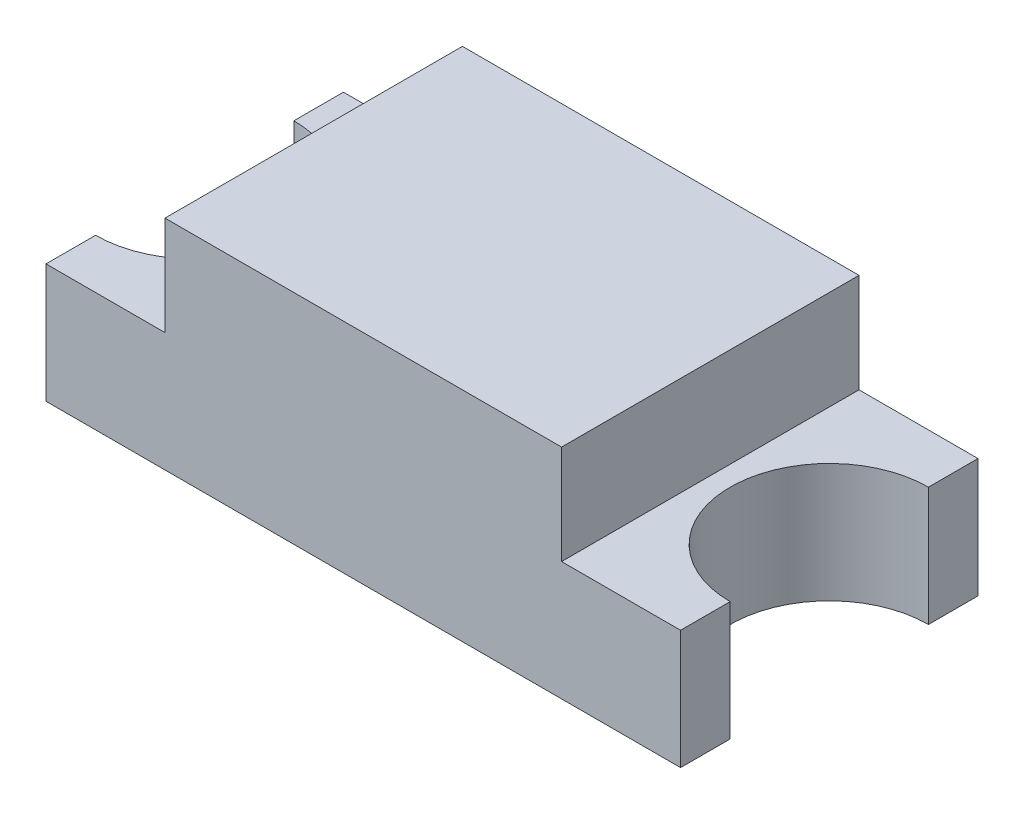
ISO-10303-21;
HEADER;
FILE_DESCRIPTION(('STEP AP214'),'2;1');
FILE_NAME('part.step','',(''),(''),'','','');
FILE_SCHEMA(('AUTOMOTIVE_DESIGN { 1 0 10303 214 1 1 1 1 }'));
ENDSEC;
DATA;
#1=APPLICATION_CONTEXT('core data for automotive mechanical design processes');
#2=APPLICATION_PROTOCOL_DEFINITION('international standard','automotive_design',2000,#1);
#3=PRODUCT_CONTEXT('',#1,'mechanical');
#4=PRODUCT('Part','Part','',(#3));
#5=PRODUCT_RELATED_PRODUCT_CATEGORY('part','',(#4));
#6=PRODUCT_DEFINITION_FORMATION('','',#4);
#7=PRODUCT_DEFINITION_CONTEXT('part definition',#1,'design');
#8=PRODUCT_DEFINITION('design','',#6,#7);
#9=PRODUCT_DEFINITION_SHAPE('','',#8);
#10=(LENGTH_UNIT() NAMED_UNIT(*) SI_UNIT(.MILLI.,.METRE.));
#11=(NAMED_UNIT(*) PLANE_ANGLE_UNIT() SI_UNIT($,.RADIAN.));
#12=(NAMED_UNIT(*) SI_UNIT($,.STERADIAN.) SOLID_ANGLE_UNIT());
#13=UNCERTAINTY_MEASURE_WITH_UNIT(LENGTH_MEASURE(1.E-05),#10,'distance_accuracy_value','');
#14=(GEOMETRIC_REPRESENTATION_CONTEXT(3) GLOBAL_UNCERTAINTY_ASSIGNED_CONTEXT((#13)) GLOBAL_UNIT_ASSIGNED_CONTEXT((#10,
#11,#12)) REPRESENTATION_CONTEXT('',''));
#15=CARTESIAN_POINT('',(0.,0.,0.));
#16=DIRECTION('',(0.,0.,1.));
#17=DIRECTION('',(1.,0.,0.));
#18=AXIS2_PLACEMENT_3D('',#15,#16,#17);
#19=CARTESIAN_POINT('',(-1.,1.1,0.750000000000001));
#20=DIRECTION('',(1.,0.,0.));
#21=DIRECTION('',(0.,0.,-1.));
#22=AXIS2_PLACEMENT_3D('',#19,#20,#21);
#23=PLANE('',#22);
#24=DIRECTION('',(0.,1.,0.));
#25=VECTOR('',#24,1.);
#26=CARTESIAN_POINT('',(-1.,1.1,0.750000000000001));
#27=LINE('',#26,#25);
#28=CARTESIAN_POINT('',(-1.,1.1,0.750000000000001));
#29=VERTEX_POINT('',#28);
#30=CARTESIAN_POINT('',(-1.,0.6,0.750000000000001));
#31=VERTEX_POINT('',#30);
#32=EDGE_CURVE('E165',#29,#31,#27,.F.);
#33=ORIENTED_EDGE('',*,*,#32,.F.);
#34=DIRECTION('',(0.,0.,-1.));
#35=VECTOR('',#34,1.);
#36=CARTESIAN_POINT('',(-1.,1.1,0.));
#37=LINE('',#36,#35);
#38=CARTESIAN_POINT('',(-1.,1.1,-0.750000000000001));
#39=VERTEX_POINT('',#38);
#40=EDGE_CURVE('E145',#29,#39,#37,.T.);
#41=ORIENTED_EDGE('',*,*,#40,.T.);
#42=DIRECTION('',(0.,1.,0.));
#43=VECTOR('',#42,1.);
#44=CARTESIAN_POINT('',(-1.,1.1,-0.750000000000001));
#45=LINE('',#44,#43);
#46=CARTESIAN_POINT('',(-1.,0.6,-0.750000000000001));
#47=VERTEX_POINT('',#46);
#48=EDGE_CURVE('E168',#47,#39,#45,.T.);
#49=ORIENTED_EDGE('',*,*,#48,.F.);
#50=DIRECTION('',(0.,0.,-1.));
#51=VECTOR('',#50,1.);
#52=CARTESIAN_POINT('',(-1.,0.6,0.));
#53=LINE('',#52,#51);
#54=EDGE_CURVE('E146',#47,#31,#53,.F.);
#55=ORIENTED_EDGE('',*,*,#54,.T.);
#56=EDGE_LOOP('',(#33,#41,#49,#55));
#57=FACE_BOUND('',#56,.T.);
#58=ADVANCED_FACE('F17',(#57),#23,.F.);
#59=CARTESIAN_POINT('',(1.,1.1,0.750000000000001));
#60=DIRECTION('',(-1.,0.,0.));
#61=DIRECTION('',(0.,0.,1.));
#62=AXIS2_PLACEMENT_3D('',#59,#60,#61);
#63=PLANE('',#62);
#64=DIRECTION('',(0.,1.,0.));
#65=VECTOR('',#64,1.);
#66=CARTESIAN_POINT('',(1.,1.1,-0.750000000000001));
#67=LINE('',#66,#65);
#68=CARTESIAN_POINT('',(1.,1.1,-0.750000000000001));
#69=VERTEX_POINT('',#68);
#70=CARTESIAN_POINT('',(1.,0.6,-0.750000000000001));
#71=VERTEX_POINT('',#70);
#72=EDGE_CURVE('E176',#69,#71,#67,.F.);
#73=ORIENTED_EDGE('',*,*,#72,.F.);
#74=DIRECTION('',(0.,0.,-1.));
#75=VECTOR('',#74,1.);
#76=CARTESIAN_POINT('',(1.,1.1,0.));
#77=LINE('',#76,#75);
#78=CARTESIAN_POINT('',(1.,1.1,0.750000000000001));
#79=VERTEX_POINT('',#78);
#80=EDGE_CURVE('E122',#69,#79,#77,.F.);
#81=ORIENTED_EDGE('',*,*,#80,.T.);
#82=DIRECTION('',(0.,1.,0.));
#83=VECTOR('',#82,1.);
#84=CARTESIAN_POINT('',(1.,1.1,0.750000000000001));
#85=LINE('',#84,#83);
#86=CARTESIAN_POINT('',(1.,0.6,0.750000000000001));
#87=VERTEX_POINT('',#86);
#88=EDGE_CURVE('E167',#87,#79,#85,.T.);
#89=ORIENTED_EDGE('',*,*,#88,.F.);
#90=DIRECTION('',(0.,0.,-1.));
#91=VECTOR('',#90,1.);
#92=CARTESIAN_POINT('',(1.,0.6,0.));
#93=LINE('',#92,#91);
#94=EDGE_CURVE('E175',#87,#71,#93,.T.);
#95=ORIENTED_EDGE('',*,*,#94,.T.);
#96=EDGE_LOOP('',(#73,#81,#89,#95));
#97=FACE_BOUND('',#96,.T.);
#98=ADVANCED_FACE('F377',(#97),#63,.F.);
#99=CARTESIAN_POINT('',(0.,0.6,0.));
#100=DIRECTION('',(0.,-1.,0.));
#101=DIRECTION('',(0.,0.,-1.));
#102=AXIS2_PLACEMENT_3D('',#99,#100,#101);
#103=PLANE('',#102);
#104=CARTESIAN_POINT('',(1.60000000000001,0.6,0.));
#105=DIRECTION('',(0.,1.,0.));
#106=DIRECTION('',(0.,0.,1.));
#107=AXIS2_PLACEMENT_3D('',#104,#105,#106);
#108=CIRCLE('',#107,0.5);
#109=CARTESIAN_POINT('',(1.60000000000001,0.6,0.5));
#110=VERTEX_POINT('',#109);
#111=CARTESIAN_POINT('',(1.60000000000001,0.6,-0.5));
#112=VERTEX_POINT('',#111);
#113=EDGE_CURVE('E20',#110,#112,#108,.F.);
#114=ORIENTED_EDGE('',*,*,#113,.T.);
#115=DIRECTION('',(0.,0.,-1.));
#116=VECTOR('',#115,1.);
#117=CARTESIAN_POINT('',(1.60000000000001,0.6,0.));
#118=LINE('',#117,#116);
#119=CARTESIAN_POINT('',(1.60000000000001,0.6,-0.750000000000001));
#120=VERTEX_POINT('',#119);
#121=EDGE_CURVE('E114',#120,#112,#118,.F.);
#122=ORIENTED_EDGE('',*,*,#121,.F.);
#123=DIRECTION('',(1.,0.,0.));
#124=VECTOR('',#123,1.);
#125=CARTESIAN_POINT('',(0.,0.6,-0.750000000000001));
#126=LINE('',#125,#124);
#127=EDGE_CURVE('E159',#71,#120,#126,.T.);
#128=ORIENTED_EDGE('',*,*,#127,.F.);
#129=ORIENTED_EDGE('',*,*,#94,.F.);
#130=DIRECTION('',(1.,0.,0.));
#131=VECTOR('',#130,1.);
#132=CARTESIAN_POINT('',(0.,0.6,0.750000000000001));
#133=LINE('',#132,#131);
#134=CARTESIAN_POINT('',(1.60000000000001,0.6,0.750000000000001));
#135=VERTEX_POINT('',#134);
#136=EDGE_CURVE('E109',#135,#87,#133,.F.);
#137=ORIENTED_EDGE('',*,*,#136,.F.);
#138=DIRECTION('',(0.,0.,-1.));
#139=VECTOR('',#138,1.);
#140=CARTESIAN_POINT('',(1.60000000000001,0.6,0.));
#141=LINE('',#140,#139);
#142=EDGE_CURVE('E103',#110,#135,#141,.F.);
#143=ORIENTED_EDGE('',*,*,#142,.F.);
#144=EDGE_LOOP('',(#114,#122,#128,#129,#137,#143));
#145=FACE_BOUND('',#144,.T.);
#146=ADVANCED_FACE('F105',(#145),#103,.F.);
#147=CARTESIAN_POINT('',(0.,0.6,0.));
#148=DIRECTION('',(0.,-1.,0.));
#149=DIRECTION('',(0.,0.,-1.));
#150=AXIS2_PLACEMENT_3D('',#147,#148,#149);
#151=PLANE('',#150);
#152=CARTESIAN_POINT('',(-1.59999999999999,0.6,0.));
#153=DIRECTION('',(0.,1.,0.));
#154=DIRECTION('',(0.,0.,1.));
#155=AXIS2_PLACEMENT_3D('',#152,#153,#154);
#156=CIRCLE('',#155,0.5);
#157=CARTESIAN_POINT('',(-1.59999999999999,0.6,-0.5));
#158=VERTEX_POINT('',#157);
#159=CARTESIAN_POINT('',(-1.59999999999999,0.6,0.5));
#160=VERTEX_POINT('',#159);
#161=EDGE_CURVE('E139',#158,#160,#156,.F.);
#162=ORIENTED_EDGE('',*,*,#161,.T.);
#163=DIRECTION('',(0.,0.,-1.));
#164=VECTOR('',#163,1.);
#165=CARTESIAN_POINT('',(-1.59999999999999,0.6,0.750000000000001));
#166=LINE('',#165,#164);
#167=CARTESIAN_POINT('',(-1.59999999999999,0.6,0.750000000000001));
#168=VERTEX_POINT('',#167);
#169=EDGE_CURVE('E136',#160,#168,#166,.F.);
#170=ORIENTED_EDGE('',*,*,#169,.T.);
#171=DIRECTION('',(-1.,0.,0.));
#172=VECTOR('',#171,1.);
#173=CARTESIAN_POINT('',(-1.59999999999999,0.6,0.750000000000001));
#174=LINE('',#173,#172);
#175=EDGE_CURVE('E127',#168,#31,#174,.F.);
#176=ORIENTED_EDGE('',*,*,#175,.T.);
#177=ORIENTED_EDGE('',*,*,#54,.F.);
#178=DIRECTION('',(1.,0.,0.));
#179=VECTOR('',#178,1.);
#180=CARTESIAN_POINT('',(0.,0.6,-0.750000000000001));
#181=LINE('',#180,#179);
#182=CARTESIAN_POINT('',(-1.59999999999999,0.6,-0.750000000000001));
#183=VERTEX_POINT('',#182);
#184=EDGE_CURVE('E113',#183,#47,#181,.T.);
#185=ORIENTED_EDGE('',*,*,#184,.F.);
#186=DIRECTION('',(0.,0.,-1.));
#187=VECTOR('',#186,1.);
#188=CARTESIAN_POINT('',(-1.59999999999999,0.6,0.));
#189=LINE('',#188,#187);
#190=EDGE_CURVE('E143',#158,#183,#189,.T.);
#191=ORIENTED_EDGE('',*,*,#190,.F.);
#192=EDGE_LOOP('',(#162,#170,#176,#177,#185,#191));
#193=FACE_BOUND('',#192,.T.);
#194=ADVANCED_FACE('F361',(#193),#151,.F.);
#195=CARTESIAN_POINT('',(0.,1.1,0.));
#196=DIRECTION('',(0.,-1.,0.));
#197=DIRECTION('',(0.,0.,-1.));
#198=AXIS2_PLACEMENT_3D('',#195,#196,#197);
#199=PLANE('',#198);
#200=DIRECTION('',(1.,0.,0.));
#201=VECTOR('',#200,1.);
#202=CARTESIAN_POINT('',(-1.59999999999999,1.1,-0.750000000000001));
#203=LINE('',#202,#201);
#204=EDGE_CURVE('E196',#69,#39,#203,.F.);
#205=ORIENTED_EDGE('',*,*,#204,.T.);
#206=ORIENTED_EDGE('',*,*,#40,.F.);
#207=DIRECTION('',(-1.,0.,0.));
#208=VECTOR('',#207,1.);
#209=CARTESIAN_POINT('',(-1.59999999999999,1.1,0.750000000000001));
#210=LINE('',#209,#208);
#211=EDGE_CURVE('E130',#29,#79,#210,.F.);
#212=ORIENTED_EDGE('',*,*,#211,.T.);
#213=ORIENTED_EDGE('',*,*,#80,.F.);
#214=EDGE_LOOP('',(#205,#206,#212,#213));
#215=FACE_BOUND('',#214,.T.);
#216=ADVANCED_FACE('F353',(#215),#199,.F.);
#217=CARTESIAN_POINT('',(1.60000000000001,-0.00100000000000002,0.));
#218=DIRECTION('',(0.,1.,0.));
#219=DIRECTION('',(0.,0.,1.));
#220=AXIS2_PLACEMENT_3D('',#217,#218,#219);
#221=CYLINDRICAL_SURFACE('',#220,0.5);
#222=CARTESIAN_POINT('',(1.60000000000001,0.,0.));
#223=DIRECTION('',(0.,1.,0.));
#224=DIRECTION('',(0.,0.,1.));
#225=AXIS2_PLACEMENT_3D('',#222,#223,#224);
#226=CIRCLE('',#225,0.5);
#227=CARTESIAN_POINT('',(1.60000000000001,0.,-0.5));
#228=VERTEX_POINT('',#227);
#229=CARTESIAN_POINT('',(1.60000000000001,0.,0.5));
#230=VERTEX_POINT('',#229);
#231=EDGE_CURVE('E217',#228,#230,#226,.T.);
#232=ORIENTED_EDGE('',*,*,#231,.F.);
#233=DIRECTION('',(0.,1.,0.));
#234=VECTOR('',#233,1.);
#235=CARTESIAN_POINT('',(1.60000000000001,0.6,-0.5));
#236=LINE('',#235,#234);
#237=EDGE_CURVE('E121',#228,#112,#236,.T.);
#238=ORIENTED_EDGE('',*,*,#237,.T.);
#239=ORIENTED_EDGE('',*,*,#113,.F.);
#240=DIRECTION('',(0.,1.,0.));
#241=VECTOR('',#240,1.);
#242=CARTESIAN_POINT('',(1.60000000000001,0.6,0.5));
#243=LINE('',#242,#241);
#244=EDGE_CURVE('E118',#110,#230,#243,.F.);
#245=ORIENTED_EDGE('',*,*,#244,.T.);
#246=EDGE_LOOP('',(#232,#238,#239,#245));
#247=FACE_BOUND('',#246,.T.);
#248=ADVANCED_FACE('F117',(#247),#221,.F.);
#249=CARTESIAN_POINT('',(1.60000000000001,0.6,0.750000000000001));
#250=DIRECTION('',(-1.,0.,0.));
#251=DIRECTION('',(0.,0.,1.));
#252=AXIS2_PLACEMENT_3D('',#249,#250,#251);
#253=PLANE('',#252);
#254=ORIENTED_EDGE('',*,*,#244,.F.);
#255=ORIENTED_EDGE('',*,*,#142,.T.);
#256=DIRECTION('',(0.,1.,0.));
#257=VECTOR('',#256,1.);
#258=CARTESIAN_POINT('',(1.60000000000001,0.6,0.750000000000001));
#259=LINE('',#258,#257);
#260=CARTESIAN_POINT('',(1.60000000000001,0.,0.750000000000001));
#261=VERTEX_POINT('',#260);
#262=EDGE_CURVE('E205',#135,#261,#259,.F.);
#263=ORIENTED_EDGE('',*,*,#262,.T.);
#264=DIRECTION('',(0.,0.,-1.));
#265=VECTOR('',#264,1.);
#266=CARTESIAN_POINT('',(1.60000000000001,0.,0.));
#267=LINE('',#266,#265);
#268=EDGE_CURVE('E125',#230,#261,#267,.F.);
#269=ORIENTED_EDGE('',*,*,#268,.F.);
#270=EDGE_LOOP('',(#254,#255,#263,#269));
#271=FACE_BOUND('',#270,.T.);
#272=ADVANCED_FACE('F123',(#271),#253,.F.);
#273=CARTESIAN_POINT('',(-1.59999999999999,0.6,0.750000000000001));
#274=DIRECTION('',(0.,0.,-1.));
#275=DIRECTION('',(-1.,0.,0.));
#276=AXIS2_PLACEMENT_3D('',#273,#274,#275);
#277=PLANE('',#276);
#278=ORIENTED_EDGE('',*,*,#262,.F.);
#279=ORIENTED_EDGE('',*,*,#136,.T.);
#280=ORIENTED_EDGE('',*,*,#88,.T.);
#281=ORIENTED_EDGE('',*,*,#211,.F.);
#282=ORIENTED_EDGE('',*,*,#32,.T.);
#283=ORIENTED_EDGE('',*,*,#175,.F.);
#284=DIRECTION('',(0.,1.,0.));
#285=VECTOR('',#284,1.);
#286=CARTESIAN_POINT('',(-1.59999999999999,0.6,0.750000000000001));
#287=LINE('',#286,#285);
#288=CARTESIAN_POINT('',(-1.59999999999999,0.,0.750000000000001));
#289=VERTEX_POINT('',#288);
#290=EDGE_CURVE('E140',#168,#289,#287,.F.);
#291=ORIENTED_EDGE('',*,*,#290,.T.);
#292=DIRECTION('',(1.,0.,0.));
#293=VECTOR('',#292,1.);
#294=CARTESIAN_POINT('',(0.,0.,0.750000000000001));
#295=LINE('',#294,#293);
#296=EDGE_CURVE('E233',#261,#289,#295,.F.);
#297=ORIENTED_EDGE('',*,*,#296,.F.);
#298=EDGE_LOOP('',(#278,#279,#280,#281,#282,#283,#291,#297));
#299=FACE_BOUND('',#298,.T.);
#300=ADVANCED_FACE('F239',(#299),#277,.F.);
#301=CARTESIAN_POINT('',(-1.59999999999999,0.6,0.750000000000001));
#302=DIRECTION('',(1.,0.,0.));
#303=DIRECTION('',(0.,0.,-1.));
#304=AXIS2_PLACEMENT_3D('',#301,#302,#303);
#305=PLANE('',#304);
#306=DIRECTION('',(0.,1.,0.));
#307=VECTOR('',#306,1.);
#308=CARTESIAN_POINT('',(-1.59999999999999,-0.00100000000000002,0.5));
#309=LINE('',#308,#307);
#310=CARTESIAN_POINT('',(-1.59999999999999,0.,0.5));
#311=VERTEX_POINT('',#310);
#312=EDGE_CURVE('E218',#160,#311,#309,.F.);
#313=ORIENTED_EDGE('',*,*,#312,.T.);
#314=DIRECTION('',(0.,0.,-1.));
#315=VECTOR('',#314,1.);
#316=CARTESIAN_POINT('',(-1.59999999999999,0.,0.));
#317=LINE('',#316,#315);
#318=EDGE_CURVE('E216',#289,#311,#317,.T.);
#319=ORIENTED_EDGE('',*,*,#318,.F.);
#320=ORIENTED_EDGE('',*,*,#290,.F.);
#321=ORIENTED_EDGE('',*,*,#169,.F.);
#322=EDGE_LOOP('',(#313,#319,#320,#321));
#323=FACE_BOUND('',#322,.T.);
#324=ADVANCED_FACE('F273',(#323),#305,.F.);
#325=CARTESIAN_POINT('',(-1.59999999999999,-0.00100000000000002,0.));
#326=DIRECTION('',(0.,1.,0.));
#327=DIRECTION('',(0.,0.,1.));
#328=AXIS2_PLACEMENT_3D('',#325,#326,#327);
#329=CYLINDRICAL_SURFACE('',#328,0.5);
#330=CARTESIAN_POINT('',(-1.59999999999999,0.,0.));
#331=DIRECTION('',(0.,1.,0.));
#332=DIRECTION('',(0.,0.,1.));
#333=AXIS2_PLACEMENT_3D('',#330,#331,#332);
#334=CIRCLE('',#333,0.5);
#335=CARTESIAN_POINT('',(-1.59999999999999,0.,-0.5));
#336=VERTEX_POINT('',#335);
#337=EDGE_CURVE('E212',#311,#336,#334,.T.);
#338=ORIENTED_EDGE('',*,*,#337,.F.);
#339=ORIENTED_EDGE('',*,*,#312,.F.);
#340=ORIENTED_EDGE('',*,*,#161,.F.);
#341=DIRECTION('',(0.,1.,0.));
#342=VECTOR('',#341,1.);
#343=CARTESIAN_POINT('',(-1.59999999999999,0.6,-0.5));
#344=LINE('',#343,#342);
#345=EDGE_CURVE('E200',#158,#336,#344,.F.);
#346=ORIENTED_EDGE('',*,*,#345,.T.);
#347=EDGE_LOOP('',(#338,#339,#340,#346));
#348=FACE_BOUND('',#347,.T.);
#349=ADVANCED_FACE('F275',(#348),#329,.F.);
#350=CARTESIAN_POINT('',(-1.59999999999999,0.6,0.750000000000001));
#351=DIRECTION('',(1.,0.,0.));
#352=DIRECTION('',(0.,0.,-1.));
#353=AXIS2_PLACEMENT_3D('',#350,#351,#352);
#354=PLANE('',#353);
#355=ORIENTED_EDGE('',*,*,#345,.F.);
#356=ORIENTED_EDGE('',*,*,#190,.T.);
#357=DIRECTION('',(0.,1.,0.));
#358=VECTOR('',#357,1.);
#359=CARTESIAN_POINT('',(-1.59999999999999,0.6,-0.750000000000001));
#360=LINE('',#359,#358);
#361=CARTESIAN_POINT('',(-1.59999999999999,0.,-0.750000000000001));
#362=VERTEX_POINT('',#361);
#363=EDGE_CURVE('E199',#183,#362,#360,.F.);
#364=ORIENTED_EDGE('',*,*,#363,.T.);
#365=DIRECTION('',(0.,0.,-1.));
#366=VECTOR('',#365,1.);
#367=CARTESIAN_POINT('',(-1.59999999999999,0.,0.));
#368=LINE('',#367,#366);
#369=EDGE_CURVE('E215',#336,#362,#368,.T.);
#370=ORIENTED_EDGE('',*,*,#369,.F.);
#371=EDGE_LOOP('',(#355,#356,#364,#370));
#372=FACE_BOUND('',#371,.T.);
#373=ADVANCED_FACE('F264',(#372),#354,.F.);
#374=CARTESIAN_POINT('',(-1.59999999999999,0.6,-0.750000000000001));
#375=DIRECTION('',(0.,0.,1.));
#376=DIRECTION('',(1.,0.,0.));
#377=AXIS2_PLACEMENT_3D('',#374,#375,#376);
#378=PLANE('',#377);
#379=ORIENTED_EDGE('',*,*,#363,.F.);
#380=ORIENTED_EDGE('',*,*,#184,.T.);
#381=ORIENTED_EDGE('',*,*,#48,.T.);
#382=ORIENTED_EDGE('',*,*,#204,.F.);
#383=ORIENTED_EDGE('',*,*,#72,.T.);
#384=ORIENTED_EDGE('',*,*,#127,.T.);
#385=DIRECTION('',(0.,1.,0.));
#386=VECTOR('',#385,1.);
#387=CARTESIAN_POINT('',(1.60000000000001,0.6,-0.750000000000001));
#388=LINE('',#387,#386);
#389=CARTESIAN_POINT('',(1.60000000000001,0.,-0.750000000000001));
#390=VERTEX_POINT('',#389);
#391=EDGE_CURVE('E35',#120,#390,#388,.F.);
#392=ORIENTED_EDGE('',*,*,#391,.T.);
#393=DIRECTION('',(1.,0.,0.));
#394=VECTOR('',#393,1.);
#395=CARTESIAN_POINT('',(0.,0.,-0.750000000000001));
#396=LINE('',#395,#394);
#397=EDGE_CURVE('E26',#362,#390,#396,.T.);
#398=ORIENTED_EDGE('',*,*,#397,.F.);
#399=EDGE_LOOP('',(#379,#380,#381,#382,#383,#384,#392,#398));
#400=FACE_BOUND('',#399,.T.);
#401=ADVANCED_FACE('F267',(#400),#378,.F.);
#402=CARTESIAN_POINT('',(1.60000000000001,0.6,0.750000000000001));
#403=DIRECTION('',(-1.,0.,0.));
#404=DIRECTION('',(0.,0.,1.));
#405=AXIS2_PLACEMENT_3D('',#402,#403,#404);
#406=PLANE('',#405);
#407=ORIENTED_EDGE('',*,*,#237,.F.);
#408=DIRECTION('',(0.,0.,-1.));
#409=VECTOR('',#408,1.);
#410=CARTESIAN_POINT('',(1.60000000000001,0.,0.));
#411=LINE('',#410,#409);
#412=EDGE_CURVE('E11',#390,#228,#411,.F.);
#413=ORIENTED_EDGE('',*,*,#412,.F.);
#414=ORIENTED_EDGE('',*,*,#391,.F.);
#415=ORIENTED_EDGE('',*,*,#121,.T.);
#416=EDGE_LOOP('',(#407,#413,#414,#415));
#417=FACE_BOUND('',#416,.T.);
#418=ADVANCED_FACE('F286',(#417),#406,.F.);
#419=CARTESIAN_POINT('',(0.,0.,0.));
#420=DIRECTION('',(0.,-1.,0.));
#421=DIRECTION('',(0.,0.,-1.));
#422=AXIS2_PLACEMENT_3D('',#419,#420,#421);
#423=PLANE('',#422);
#424=ORIENTED_EDGE('',*,*,#397,.T.);
#425=ORIENTED_EDGE('',*,*,#412,.T.);
#426=ORIENTED_EDGE('',*,*,#231,.T.);
#427=ORIENTED_EDGE('',*,*,#268,.T.);
#428=ORIENTED_EDGE('',*,*,#296,.T.);
#429=ORIENTED_EDGE('',*,*,#318,.T.);
#430=ORIENTED_EDGE('',*,*,#337,.T.);
#431=ORIENTED_EDGE('',*,*,#369,.T.);
#432=EDGE_LOOP('',(#424,#425,#426,#427,#428,#429,#430,#431));
#433=FACE_BOUND('',#432,.T.);
#434=ADVANCED_FACE('F244',(#433),#423,.T.);
#435=CLOSED_SHELL('',(#58,#98,#146,#194,#216,#248,#272,#300,#324,#349,#373,#401,#418,#434));
#436=MANIFOLD_SOLID_BREP('B1',#435);
#437=ADVANCED_BREP_SHAPE_REPRESENTATION('',(#18,#436),#14);
#438=SHAPE_DEFINITION_REPRESENTATION(#9,#437);
ENDSEC;
END-ISO-10303-21;
